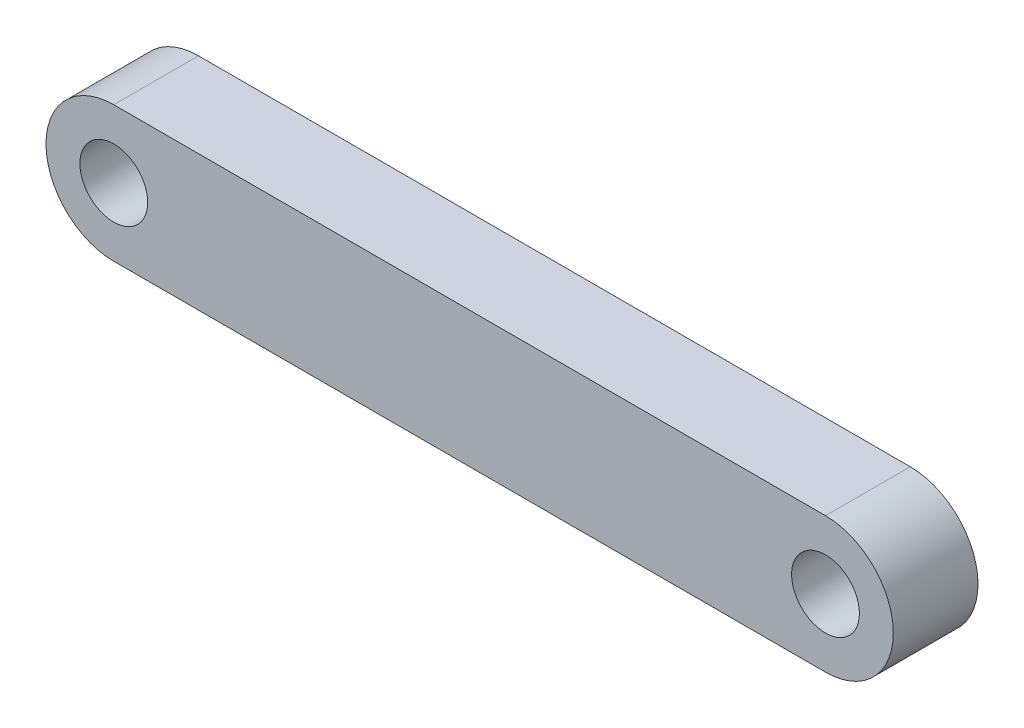
ISO-10303-21;
HEADER;
FILE_DESCRIPTION(('STEP AP214'),'2;1');
FILE_NAME('part.step','',(''),(''),'','','');
FILE_SCHEMA(('AUTOMOTIVE_DESIGN { 1 0 10303 214 1 1 1 1 }'));
ENDSEC;
DATA;
#1=APPLICATION_CONTEXT('core data for automotive mechanical design processes');
#2=APPLICATION_PROTOCOL_DEFINITION('international standard','automotive_design',2000,#1);
#3=PRODUCT_CONTEXT('',#1,'mechanical');
#4=PRODUCT('Part','Part','',(#3));
#5=PRODUCT_RELATED_PRODUCT_CATEGORY('part','',(#4));
#6=PRODUCT_DEFINITION_FORMATION('','',#4);
#7=PRODUCT_DEFINITION_CONTEXT('part definition',#1,'design');
#8=PRODUCT_DEFINITION('design','',#6,#7);
#9=PRODUCT_DEFINITION_SHAPE('','',#8);
#10=(LENGTH_UNIT() NAMED_UNIT(*) SI_UNIT(.MILLI.,.METRE.));
#11=(NAMED_UNIT(*) PLANE_ANGLE_UNIT() SI_UNIT($,.RADIAN.));
#12=(NAMED_UNIT(*) SI_UNIT($,.STERADIAN.) SOLID_ANGLE_UNIT());
#13=UNCERTAINTY_MEASURE_WITH_UNIT(LENGTH_MEASURE(1.E-05),#10,'distance_accuracy_value','');
#14=(GEOMETRIC_REPRESENTATION_CONTEXT(3) GLOBAL_UNCERTAINTY_ASSIGNED_CONTEXT((#13)) GLOBAL_UNIT_ASSIGNED_CONTEXT((#10,
#11,#12)) REPRESENTATION_CONTEXT('',''));
#15=CARTESIAN_POINT('',(0.,0.,0.));
#16=DIRECTION('',(0.,0.,1.));
#17=DIRECTION('',(1.,0.,0.));
#18=AXIS2_PLACEMENT_3D('',#15,#16,#17);
#19=CARTESIAN_POINT('',(0.,0.,2.5));
#20=DIRECTION('',(0.,0.,-1.));
#21=DIRECTION('',(-1.,0.,0.));
#22=AXIS2_PLACEMENT_3D('',#19,#20,#21);
#23=CYLINDRICAL_SURFACE('',#22,4.);
#24=CARTESIAN_POINT('',(0.,0.,-2.5));
#25=DIRECTION('',(0.,0.,1.));
#26=DIRECTION('',(1.,0.,0.));
#27=AXIS2_PLACEMENT_3D('',#24,#25,#26);
#28=CIRCLE('',#27,4.);
#29=CARTESIAN_POINT('',(0.,4.,-2.5));
#30=VERTEX_POINT('',#29);
#31=CARTESIAN_POINT('',(0.,-4.,-2.5));
#32=VERTEX_POINT('',#31);
#33=EDGE_CURVE('E111',#30,#32,#28,.T.);
#34=ORIENTED_EDGE('',*,*,#33,.T.);
#35=DIRECTION('',(0.,0.,-1.));
#36=VECTOR('',#35,1.);
#37=CARTESIAN_POINT('',(0.,-4.,2.5));
#38=LINE('',#37,#36);
#39=CARTESIAN_POINT('',(0.,-4.,2.5));
#40=VERTEX_POINT('',#39);
#41=EDGE_CURVE('E11',#40,#32,#38,.T.);
#42=ORIENTED_EDGE('',*,*,#41,.F.);
#43=CARTESIAN_POINT('',(0.,0.,2.5));
#44=DIRECTION('',(0.,0.,1.));
#45=DIRECTION('',(1.,0.,0.));
#46=AXIS2_PLACEMENT_3D('',#43,#44,#45);
#47=CIRCLE('',#46,4.);
#48=CARTESIAN_POINT('',(0.,4.,2.5));
#49=VERTEX_POINT('',#48);
#50=EDGE_CURVE('E95',#49,#40,#47,.T.);
#51=ORIENTED_EDGE('',*,*,#50,.F.);
#52=DIRECTION('',(0.,0.,-1.));
#53=VECTOR('',#52,1.);
#54=CARTESIAN_POINT('',(0.,4.,2.5));
#55=LINE('',#54,#53);
#56=EDGE_CURVE('E107',#49,#30,#55,.T.);
#57=ORIENTED_EDGE('',*,*,#56,.T.);
#58=EDGE_LOOP('',(#34,#42,#51,#57));
#59=FACE_BOUND('',#58,.T.);
#60=ADVANCED_FACE('F43',(#59),#23,.T.);
#61=CARTESIAN_POINT('',(0.,-4.,2.5));
#62=DIRECTION('',(0.,1.,0.));
#63=DIRECTION('',(0.,0.,1.));
#64=AXIS2_PLACEMENT_3D('',#61,#62,#63);
#65=PLANE('',#64);
#66=DIRECTION('',(1.,0.,0.));
#67=VECTOR('',#66,1.);
#68=CARTESIAN_POINT('',(0.,-4.,-2.5));
#69=LINE('',#68,#67);
#70=CARTESIAN_POINT('',(42.,-4.,-2.5));
#71=VERTEX_POINT('',#70);
#72=EDGE_CURVE('E100',#32,#71,#69,.T.);
#73=ORIENTED_EDGE('',*,*,#72,.T.);
#74=DIRECTION('',(0.,0.,-1.));
#75=VECTOR('',#74,1.);
#76=CARTESIAN_POINT('',(42.,-4.,2.5));
#77=LINE('',#76,#75);
#78=CARTESIAN_POINT('',(42.,-4.,2.5));
#79=VERTEX_POINT('',#78);
#80=EDGE_CURVE('E52',#79,#71,#77,.T.);
#81=ORIENTED_EDGE('',*,*,#80,.F.);
#82=DIRECTION('',(1.,0.,0.));
#83=VECTOR('',#82,1.);
#84=CARTESIAN_POINT('',(0.,-4.,2.5));
#85=LINE('',#84,#83);
#86=EDGE_CURVE('E90',#40,#79,#85,.T.);
#87=ORIENTED_EDGE('',*,*,#86,.F.);
#88=ORIENTED_EDGE('',*,*,#41,.T.);
#89=EDGE_LOOP('',(#73,#81,#87,#88));
#90=FACE_BOUND('',#89,.T.);
#91=ADVANCED_FACE('F99',(#90),#65,.F.);
#92=CARTESIAN_POINT('',(42.,0.,2.5));
#93=DIRECTION('',(0.,0.,-1.));
#94=DIRECTION('',(-1.,0.,0.));
#95=AXIS2_PLACEMENT_3D('',#92,#93,#94);
#96=CYLINDRICAL_SURFACE('',#95,4.);
#97=CARTESIAN_POINT('',(42.,0.,-2.5));
#98=DIRECTION('',(0.,0.,1.));
#99=DIRECTION('',(1.,0.,0.));
#100=AXIS2_PLACEMENT_3D('',#97,#98,#99);
#101=CIRCLE('',#100,4.);
#102=CARTESIAN_POINT('',(42.,4.,-2.5));
#103=VERTEX_POINT('',#102);
#104=EDGE_CURVE('E77',#71,#103,#101,.T.);
#105=ORIENTED_EDGE('',*,*,#104,.T.);
#106=DIRECTION('',(0.,0.,-1.));
#107=VECTOR('',#106,1.);
#108=CARTESIAN_POINT('',(42.,4.,2.5));
#109=LINE('',#108,#107);
#110=CARTESIAN_POINT('',(42.,4.,2.5));
#111=VERTEX_POINT('',#110);
#112=EDGE_CURVE('E102',#111,#103,#109,.T.);
#113=ORIENTED_EDGE('',*,*,#112,.F.);
#114=CARTESIAN_POINT('',(42.,0.,2.5));
#115=DIRECTION('',(0.,0.,1.));
#116=DIRECTION('',(1.,0.,0.));
#117=AXIS2_PLACEMENT_3D('',#114,#115,#116);
#118=CIRCLE('',#117,4.);
#119=EDGE_CURVE('E93',#79,#111,#118,.T.);
#120=ORIENTED_EDGE('',*,*,#119,.F.);
#121=ORIENTED_EDGE('',*,*,#80,.T.);
#122=EDGE_LOOP('',(#105,#113,#120,#121));
#123=FACE_BOUND('',#122,.T.);
#124=ADVANCED_FACE('F103',(#123),#96,.T.);
#125=CARTESIAN_POINT('',(0.,4.,2.5));
#126=DIRECTION('',(0.,-1.,0.));
#127=DIRECTION('',(0.,0.,-1.));
#128=AXIS2_PLACEMENT_3D('',#125,#126,#127);
#129=PLANE('',#128);
#130=DIRECTION('',(-1.,0.,0.));
#131=VECTOR('',#130,1.);
#132=CARTESIAN_POINT('',(0.,4.,-2.5));
#133=LINE('',#132,#131);
#134=EDGE_CURVE('E83',#103,#30,#133,.T.);
#135=ORIENTED_EDGE('',*,*,#134,.T.);
#136=ORIENTED_EDGE('',*,*,#56,.F.);
#137=DIRECTION('',(-1.,0.,0.));
#138=VECTOR('',#137,1.);
#139=CARTESIAN_POINT('',(0.,4.,2.5));
#140=LINE('',#139,#138);
#141=EDGE_CURVE('E60',#111,#49,#140,.T.);
#142=ORIENTED_EDGE('',*,*,#141,.F.);
#143=ORIENTED_EDGE('',*,*,#112,.T.);
#144=EDGE_LOOP('',(#135,#136,#142,#143));
#145=FACE_BOUND('',#144,.T.);
#146=ADVANCED_FACE('F125',(#145),#129,.F.);
#147=CARTESIAN_POINT('',(0.,0.,2.5));
#148=DIRECTION('',(0.,0.,1.));
#149=DIRECTION('',(1.,0.,0.));
#150=AXIS2_PLACEMENT_3D('',#147,#148,#149);
#151=PLANE('',#150);
#152=CARTESIAN_POINT('',(42.,0.,2.5));
#153=DIRECTION('',(0.,0.,1.));
#154=DIRECTION('',(1.,0.,0.));
#155=AXIS2_PLACEMENT_3D('',#152,#153,#154);
#156=CIRCLE('',#155,2.);
#157=CARTESIAN_POINT('',(44.,0.,2.5));
#158=VERTEX_POINT('',#157);
#159=EDGE_CURVE('E140',#158,#158,#156,.T.);
#160=ORIENTED_EDGE('',*,*,#159,.F.);
#161=EDGE_LOOP('',(#160));
#162=FACE_BOUND('',#161,.T.);
#163=CARTESIAN_POINT('',(0.,0.,2.5));
#164=DIRECTION('',(0.,0.,1.));
#165=DIRECTION('',(1.,0.,0.));
#166=AXIS2_PLACEMENT_3D('',#163,#164,#165);
#167=CIRCLE('',#166,2.);
#168=CARTESIAN_POINT('',(2.,0.,2.5));
#169=VERTEX_POINT('',#168);
#170=EDGE_CURVE('E136',#169,#169,#167,.T.);
#171=ORIENTED_EDGE('',*,*,#170,.F.);
#172=EDGE_LOOP('',(#171));
#173=FACE_BOUND('',#172,.T.);
#174=ORIENTED_EDGE('',*,*,#50,.T.);
#175=ORIENTED_EDGE('',*,*,#86,.T.);
#176=ORIENTED_EDGE('',*,*,#119,.T.);
#177=ORIENTED_EDGE('',*,*,#141,.T.);
#178=EDGE_LOOP('',(#174,#175,#176,#177));
#179=FACE_BOUND('',#178,.T.);
#180=ADVANCED_FACE('F91',(#162,#173,#179),#151,.T.);
#181=CARTESIAN_POINT('',(0.,0.,-2.5));
#182=DIRECTION('',(0.,0.,1.));
#183=DIRECTION('',(1.,0.,0.));
#184=AXIS2_PLACEMENT_3D('',#181,#182,#183);
#185=PLANE('',#184);
#186=CARTESIAN_POINT('',(42.,0.,-2.5));
#187=DIRECTION('',(0.,0.,1.));
#188=DIRECTION('',(1.,0.,0.));
#189=AXIS2_PLACEMENT_3D('',#186,#187,#188);
#190=CIRCLE('',#189,2.);
#191=CARTESIAN_POINT('',(44.,0.,-2.5));
#192=VERTEX_POINT('',#191);
#193=EDGE_CURVE('E115',#192,#192,#190,.T.);
#194=ORIENTED_EDGE('',*,*,#193,.T.);
#195=EDGE_LOOP('',(#194));
#196=FACE_BOUND('',#195,.T.);
#197=CARTESIAN_POINT('',(0.,0.,-2.5));
#198=DIRECTION('',(0.,0.,1.));
#199=DIRECTION('',(1.,0.,0.));
#200=AXIS2_PLACEMENT_3D('',#197,#198,#199);
#201=CIRCLE('',#200,2.);
#202=CARTESIAN_POINT('',(2.,0.,-2.5));
#203=VERTEX_POINT('',#202);
#204=EDGE_CURVE('E132',#203,#203,#201,.T.);
#205=ORIENTED_EDGE('',*,*,#204,.T.);
#206=EDGE_LOOP('',(#205));
#207=FACE_BOUND('',#206,.T.);
#208=ORIENTED_EDGE('',*,*,#33,.F.);
#209=ORIENTED_EDGE('',*,*,#134,.F.);
#210=ORIENTED_EDGE('',*,*,#104,.F.);
#211=ORIENTED_EDGE('',*,*,#72,.F.);
#212=EDGE_LOOP('',(#208,#209,#210,#211));
#213=FACE_BOUND('',#212,.T.);
#214=ADVANCED_FACE('F128',(#196,#207,#213),#185,.F.);
#215=CARTESIAN_POINT('',(0.,0.,-2.5));
#216=DIRECTION('',(0.,0.,1.));
#217=DIRECTION('',(1.,0.,0.));
#218=AXIS2_PLACEMENT_3D('',#215,#216,#217);
#219=CYLINDRICAL_SURFACE('',#218,2.);
#220=ORIENTED_EDGE('',*,*,#204,.F.);
#221=EDGE_LOOP('',(#220));
#222=FACE_BOUND('',#221,.T.);
#223=ORIENTED_EDGE('',*,*,#170,.T.);
#224=EDGE_LOOP('',(#223));
#225=FACE_BOUND('',#224,.T.);
#226=ADVANCED_FACE('F153',(#222,#225),#219,.F.);
#227=CARTESIAN_POINT('',(42.,0.,-2.5));
#228=DIRECTION('',(0.,0.,1.));
#229=DIRECTION('',(1.,0.,0.));
#230=AXIS2_PLACEMENT_3D('',#227,#228,#229);
#231=CYLINDRICAL_SURFACE('',#230,2.);
#232=ORIENTED_EDGE('',*,*,#193,.F.);
#233=EDGE_LOOP('',(#232));
#234=FACE_BOUND('',#233,.T.);
#235=ORIENTED_EDGE('',*,*,#159,.T.);
#236=EDGE_LOOP('',(#235));
#237=FACE_BOUND('',#236,.T.);
#238=ADVANCED_FACE('F150',(#234,#237),#231,.F.);
#239=CLOSED_SHELL('',(#60,#91,#124,#146,#180,#214,#226,#238));
#240=MANIFOLD_SOLID_BREP('B2',#239);
#241=ADVANCED_BREP_SHAPE_REPRESENTATION('',(#18,#240),#14);
#242=SHAPE_DEFINITION_REPRESENTATION(#9,#241);
ENDSEC;
END-ISO-10303-21;
